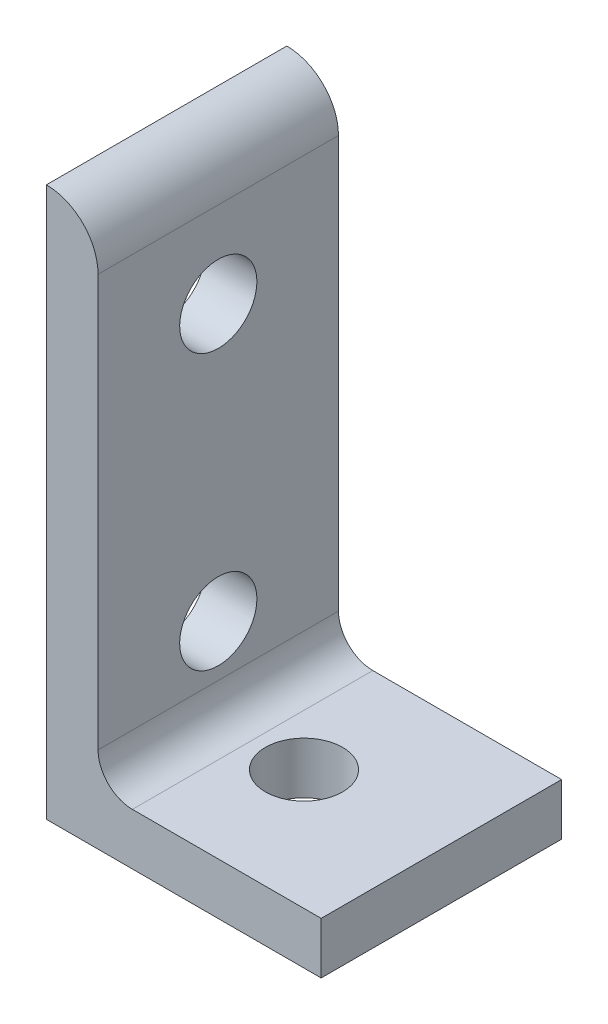
ISO-10303-21;
HEADER;
FILE_DESCRIPTION(('STEP AP214'),'2;1');
FILE_NAME('part.step','',(''),(''),'','','');
FILE_SCHEMA(('AUTOMOTIVE_DESIGN { 1 0 10303 214 1 1 1 1 }'));
ENDSEC;
DATA;
#1=APPLICATION_CONTEXT('core data for automotive mechanical design processes');
#2=APPLICATION_PROTOCOL_DEFINITION('international standard','automotive_design',2000,#1);
#3=PRODUCT_CONTEXT('',#1,'mechanical');
#4=PRODUCT('Part','Part','',(#3));
#5=PRODUCT_RELATED_PRODUCT_CATEGORY('part','',(#4));
#6=PRODUCT_DEFINITION_FORMATION('','',#4);
#7=PRODUCT_DEFINITION_CONTEXT('part definition',#1,'design');
#8=PRODUCT_DEFINITION('design','',#6,#7);
#9=PRODUCT_DEFINITION_SHAPE('','',#8);
#10=(LENGTH_UNIT() NAMED_UNIT(*) SI_UNIT(.MILLI.,.METRE.));
#11=(NAMED_UNIT(*) PLANE_ANGLE_UNIT() SI_UNIT($,.RADIAN.));
#12=(NAMED_UNIT(*) SI_UNIT($,.STERADIAN.) SOLID_ANGLE_UNIT());
#13=UNCERTAINTY_MEASURE_WITH_UNIT(LENGTH_MEASURE(1.E-05),#10,'distance_accuracy_value','');
#14=(GEOMETRIC_REPRESENTATION_CONTEXT(3) GLOBAL_UNCERTAINTY_ASSIGNED_CONTEXT((#13)) GLOBAL_UNIT_ASSIGNED_CONTEXT((#10,
#11,#12)) REPRESENTATION_CONTEXT('',''));
#15=CARTESIAN_POINT('',(0.,0.,0.));
#16=DIRECTION('',(0.,0.,1.));
#17=DIRECTION('',(1.,0.,0.));
#18=AXIS2_PLACEMENT_3D('',#15,#16,#17);
#19=CARTESIAN_POINT('',(4.7752,46.0248,11.1125));
#20=DIRECTION('',(-1.,0.,0.));
#21=DIRECTION('',(0.,-1.,0.));
#22=AXIS2_PLACEMENT_3D('',#19,#20,#21);
#23=PLANE('',#22);
#24=CARTESIAN_POINT('',(4.7752,12.7,0.));
#25=DIRECTION('',(-1.,0.,0.));
#26=DIRECTION('',(0.,-1.,0.));
#27=AXIS2_PLACEMENT_3D('',#24,#25,#26);
#28=CIRCLE('',#27,3.5687);
#29=CARTESIAN_POINT('',(4.7752,9.1313,0.));
#30=VERTEX_POINT('',#29);
#31=EDGE_CURVE('E154',#30,#30,#28,.F.);
#32=ORIENTED_EDGE('',*,*,#31,.F.);
#33=EDGE_LOOP('',(#32));
#34=FACE_BOUND('',#33,.T.);
#35=DIRECTION('',(0.,1.,0.));
#36=VECTOR('',#35,1.);
#37=CARTESIAN_POINT('',(4.7752,46.0248,-11.1125));
#38=LINE('',#37,#36);
#39=CARTESIAN_POINT('',(4.7752,7.9502,-11.1125));
#40=VERTEX_POINT('',#39);
#41=CARTESIAN_POINT('',(4.77519999999999,46.0248,-11.1125));
#42=VERTEX_POINT('',#41);
#43=EDGE_CURVE('E113',#40,#42,#38,.T.);
#44=ORIENTED_EDGE('',*,*,#43,.T.);
#45=DIRECTION('',(0.,0.,-1.));
#46=VECTOR('',#45,1.);
#47=CARTESIAN_POINT('',(4.77519999999999,46.0248,11.1125));
#48=LINE('',#47,#46);
#49=CARTESIAN_POINT('',(4.77519999999999,46.0248,11.1125));
#50=VERTEX_POINT('',#49);
#51=EDGE_CURVE('E110',#50,#42,#48,.T.);
#52=ORIENTED_EDGE('',*,*,#51,.F.);
#53=DIRECTION('',(0.,1.,0.));
#54=VECTOR('',#53,1.);
#55=CARTESIAN_POINT('',(4.7752,46.0248,11.1125));
#56=LINE('',#55,#54);
#57=CARTESIAN_POINT('',(4.7752,7.9502,11.1125));
#58=VERTEX_POINT('',#57);
#59=EDGE_CURVE('E97',#58,#50,#56,.T.);
#60=ORIENTED_EDGE('',*,*,#59,.F.);
#61=DIRECTION('',(0.,0.,-1.));
#62=VECTOR('',#61,1.);
#63=CARTESIAN_POINT('',(4.7752,7.9502,11.1125));
#64=LINE('',#63,#62);
#65=EDGE_CURVE('E42',#58,#40,#64,.T.);
#66=ORIENTED_EDGE('',*,*,#65,.T.);
#67=EDGE_LOOP('',(#44,#52,#60,#66));
#68=FACE_BOUND('',#67,.T.);
#69=CARTESIAN_POINT('',(4.77519999999999,38.1,0.));
#70=DIRECTION('',(-1.,0.,0.));
#71=DIRECTION('',(0.,-1.,0.));
#72=AXIS2_PLACEMENT_3D('',#69,#70,#71);
#73=CIRCLE('',#72,3.5687);
#74=CARTESIAN_POINT('',(4.77519999999999,34.5313,0.));
#75=VERTEX_POINT('',#74);
#76=EDGE_CURVE('E160',#75,#75,#73,.F.);
#77=ORIENTED_EDGE('',*,*,#76,.F.);
#78=EDGE_LOOP('',(#77));
#79=FACE_BOUND('',#78,.T.);
#80=ADVANCED_FACE('F33',(#34,#68,#79),#23,.F.);
#81=CARTESIAN_POINT('',(0.,0.,11.1125));
#82=DIRECTION('',(1.,0.,0.));
#83=DIRECTION('',(0.,0.,-1.));
#84=AXIS2_PLACEMENT_3D('',#81,#82,#83);
#85=PLANE('',#84);
#86=CARTESIAN_POINT('',(0.,12.7,0.));
#87=DIRECTION('',(1.,0.,0.));
#88=DIRECTION('',(0.,0.,-1.));
#89=AXIS2_PLACEMENT_3D('',#86,#87,#88);
#90=CIRCLE('',#89,3.5687);
#91=CARTESIAN_POINT('',(0.,12.7,-3.5687));
#92=VERTEX_POINT('',#91);
#93=EDGE_CURVE('E157',#92,#92,#90,.T.);
#94=ORIENTED_EDGE('',*,*,#93,.T.);
#95=EDGE_LOOP('',(#94));
#96=FACE_BOUND('',#95,.T.);
#97=DIRECTION('',(0.,-1.,0.));
#98=VECTOR('',#97,1.);
#99=CARTESIAN_POINT('',(0.,0.,-11.1125));
#100=LINE('',#99,#98);
#101=CARTESIAN_POINT('',(0.,50.8,-11.1125));
#102=VERTEX_POINT('',#101);
#103=CARTESIAN_POINT('',(0.,0.,-11.1125));
#104=VERTEX_POINT('',#103);
#105=EDGE_CURVE('E82',#102,#104,#100,.T.);
#106=ORIENTED_EDGE('',*,*,#105,.T.);
#107=DIRECTION('',(0.,0.,-1.));
#108=VECTOR('',#107,1.);
#109=CARTESIAN_POINT('',(0.,0.,11.1125));
#110=LINE('',#109,#108);
#111=CARTESIAN_POINT('',(0.,0.,11.1125));
#112=VERTEX_POINT('',#111);
#113=EDGE_CURVE('E120',#112,#104,#110,.T.);
#114=ORIENTED_EDGE('',*,*,#113,.F.);
#115=DIRECTION('',(0.,-1.,0.));
#116=VECTOR('',#115,1.);
#117=CARTESIAN_POINT('',(0.,0.,11.1125));
#118=LINE('',#117,#116);
#119=CARTESIAN_POINT('',(0.,50.8,11.1125));
#120=VERTEX_POINT('',#119);
#121=EDGE_CURVE('E58',#120,#112,#118,.T.);
#122=ORIENTED_EDGE('',*,*,#121,.F.);
#123=DIRECTION('',(0.,0.,-1.));
#124=VECTOR('',#123,1.);
#125=CARTESIAN_POINT('',(0.,50.8,11.1125));
#126=LINE('',#125,#124);
#127=EDGE_CURVE('E116',#120,#102,#126,.T.);
#128=ORIENTED_EDGE('',*,*,#127,.T.);
#129=EDGE_LOOP('',(#106,#114,#122,#128));
#130=FACE_BOUND('',#129,.T.);
#131=CARTESIAN_POINT('',(0.,38.1,0.));
#132=DIRECTION('',(1.,0.,0.));
#133=DIRECTION('',(0.,0.,-1.));
#134=AXIS2_PLACEMENT_3D('',#131,#132,#133);
#135=CIRCLE('',#134,3.5687);
#136=CARTESIAN_POINT('',(0.,38.1,-3.5687));
#137=VERTEX_POINT('',#136);
#138=EDGE_CURVE('E163',#137,#137,#135,.T.);
#139=ORIENTED_EDGE('',*,*,#138,.T.);
#140=EDGE_LOOP('',(#139));
#141=FACE_BOUND('',#140,.T.);
#142=ADVANCED_FACE('F144',(#96,#130,#141),#85,.F.);
#143=CARTESIAN_POINT('',(50.8,0.,11.1125));
#144=DIRECTION('',(0.,1.,0.));
#145=DIRECTION('',(-1.,0.,0.));
#146=AXIS2_PLACEMENT_3D('',#143,#144,#145);
#147=PLANE('',#146);
#148=CARTESIAN_POINT('',(12.7,0.,0.));
#149=DIRECTION('',(0.,1.,0.));
#150=DIRECTION('',(0.,0.,1.));
#151=AXIS2_PLACEMENT_3D('',#148,#149,#150);
#152=CIRCLE('',#151,3.5687);
#153=CARTESIAN_POINT('',(12.7,0.,3.5687));
#154=VERTEX_POINT('',#153);
#155=EDGE_CURVE('E151',#154,#154,#152,.T.);
#156=ORIENTED_EDGE('',*,*,#155,.T.);
#157=EDGE_LOOP('',(#156));
#158=FACE_BOUND('',#157,.T.);
#159=DIRECTION('',(1.,0.,0.));
#160=VECTOR('',#159,1.);
#161=CARTESIAN_POINT('',(50.8,0.,-11.1125));
#162=LINE('',#161,#160);
#163=CARTESIAN_POINT('',(25.4,0.,-11.1125));
#164=VERTEX_POINT('',#163);
#165=EDGE_CURVE('E124',#104,#164,#162,.T.);
#166=ORIENTED_EDGE('',*,*,#165,.T.);
#167=DIRECTION('',(0.,0.,-1.));
#168=VECTOR('',#167,1.);
#169=CARTESIAN_POINT('',(25.4,0.,-11.1125));
#170=LINE('',#169,#168);
#171=CARTESIAN_POINT('',(25.4,0.,11.1125));
#172=VERTEX_POINT('',#171);
#173=EDGE_CURVE('E49',#172,#164,#170,.T.);
#174=ORIENTED_EDGE('',*,*,#173,.F.);
#175=DIRECTION('',(1.,0.,0.));
#176=VECTOR('',#175,1.);
#177=CARTESIAN_POINT('',(50.8,0.,11.1125));
#178=LINE('',#177,#176);
#179=EDGE_CURVE('E135',#112,#172,#178,.T.);
#180=ORIENTED_EDGE('',*,*,#179,.F.);
#181=ORIENTED_EDGE('',*,*,#113,.T.);
#182=EDGE_LOOP('',(#166,#174,#180,#181));
#183=FACE_BOUND('',#182,.T.);
#184=ADVANCED_FACE('F35',(#158,#183),#147,.F.);
#185=CARTESIAN_POINT('',(7.9502,4.7752,11.1125));
#186=DIRECTION('',(0.,-1.,0.));
#187=DIRECTION('',(1.,0.,0.));
#188=AXIS2_PLACEMENT_3D('',#185,#186,#187);
#189=PLANE('',#188);
#190=CARTESIAN_POINT('',(12.7,4.7752,0.));
#191=DIRECTION('',(0.,-1.,0.));
#192=DIRECTION('',(1.,0.,0.));
#193=AXIS2_PLACEMENT_3D('',#190,#191,#192);
#194=CIRCLE('',#193,3.5687);
#195=CARTESIAN_POINT('',(16.2687,4.7752,0.));
#196=VERTEX_POINT('',#195);
#197=EDGE_CURVE('E37',#196,#196,#194,.F.);
#198=ORIENTED_EDGE('',*,*,#197,.F.);
#199=EDGE_LOOP('',(#198));
#200=FACE_BOUND('',#199,.T.);
#201=DIRECTION('',(-1.,0.,0.));
#202=VECTOR('',#201,1.);
#203=CARTESIAN_POINT('',(7.9502,4.7752,11.1125));
#204=LINE('',#203,#202);
#205=CARTESIAN_POINT('',(25.4,4.7752,11.1125));
#206=VERTEX_POINT('',#205);
#207=CARTESIAN_POINT('',(7.9502,4.7752,11.1125));
#208=VERTEX_POINT('',#207);
#209=EDGE_CURVE('E90',#206,#208,#204,.T.);
#210=ORIENTED_EDGE('',*,*,#209,.F.);
#211=DIRECTION('',(0.,0.,1.));
#212=VECTOR('',#211,1.);
#213=CARTESIAN_POINT('',(25.4,4.7752,-11.1125));
#214=LINE('',#213,#212);
#215=CARTESIAN_POINT('',(25.4,4.7752,-11.1125));
#216=VERTEX_POINT('',#215);
#217=EDGE_CURVE('E169',#216,#206,#214,.T.);
#218=ORIENTED_EDGE('',*,*,#217,.F.);
#219=DIRECTION('',(-1.,0.,0.));
#220=VECTOR('',#219,1.);
#221=CARTESIAN_POINT('',(7.9502,4.7752,-11.1125));
#222=LINE('',#221,#220);
#223=CARTESIAN_POINT('',(7.9502,4.7752,-11.1125));
#224=VERTEX_POINT('',#223);
#225=EDGE_CURVE('E127',#216,#224,#222,.T.);
#226=ORIENTED_EDGE('',*,*,#225,.T.);
#227=DIRECTION('',(0.,0.,-1.));
#228=VECTOR('',#227,1.);
#229=CARTESIAN_POINT('',(7.9502,4.7752,11.1125));
#230=LINE('',#229,#228);
#231=EDGE_CURVE('E11',#208,#224,#230,.T.);
#232=ORIENTED_EDGE('',*,*,#231,.F.);
#233=EDGE_LOOP('',(#210,#218,#226,#232));
#234=FACE_BOUND('',#233,.T.);
#235=ADVANCED_FACE('F178',(#200,#234),#189,.F.);
#236=CARTESIAN_POINT('',(7.9502,7.9502,11.1125));
#237=DIRECTION('',(0.,0.,-1.));
#238=DIRECTION('',(-1.,0.,0.));
#239=AXIS2_PLACEMENT_3D('',#236,#237,#238);
#240=CYLINDRICAL_SURFACE('',#239,3.175);
#241=CARTESIAN_POINT('',(7.9502,7.9502,-11.1125));
#242=DIRECTION('',(0.,0.,-1.));
#243=DIRECTION('',(1.,0.,0.));
#244=AXIS2_PLACEMENT_3D('',#241,#242,#243);
#245=CIRCLE('',#244,3.175);
#246=EDGE_CURVE('E129',#224,#40,#245,.T.);
#247=ORIENTED_EDGE('',*,*,#246,.T.);
#248=ORIENTED_EDGE('',*,*,#65,.F.);
#249=CARTESIAN_POINT('',(7.9502,7.9502,11.1125));
#250=DIRECTION('',(0.,0.,-1.));
#251=DIRECTION('',(1.,0.,0.));
#252=AXIS2_PLACEMENT_3D('',#249,#250,#251);
#253=CIRCLE('',#252,3.175);
#254=EDGE_CURVE('E104',#208,#58,#253,.T.);
#255=ORIENTED_EDGE('',*,*,#254,.F.);
#256=ORIENTED_EDGE('',*,*,#231,.T.);
#257=EDGE_LOOP('',(#247,#248,#255,#256));
#258=FACE_BOUND('',#257,.T.);
#259=ADVANCED_FACE('F179',(#258),#240,.F.);
#260=CARTESIAN_POINT('',(0.,46.0248,11.1125));
#261=DIRECTION('',(0.,0.,-1.));
#262=DIRECTION('',(-1.,0.,0.));
#263=AXIS2_PLACEMENT_3D('',#260,#261,#262);
#264=CYLINDRICAL_SURFACE('',#263,4.77519999999999);
#265=CARTESIAN_POINT('',(0.,46.0248,-11.1125));
#266=DIRECTION('',(0.,0.,1.));
#267=DIRECTION('',(1.,0.,0.));
#268=AXIS2_PLACEMENT_3D('',#265,#266,#267);
#269=CIRCLE('',#268,4.77519999999999);
#270=EDGE_CURVE('E132',#42,#102,#269,.T.);
#271=ORIENTED_EDGE('',*,*,#270,.T.);
#272=ORIENTED_EDGE('',*,*,#127,.F.);
#273=CARTESIAN_POINT('',(0.,46.0248,11.1125));
#274=DIRECTION('',(0.,0.,1.));
#275=DIRECTION('',(1.,0.,0.));
#276=AXIS2_PLACEMENT_3D('',#273,#274,#275);
#277=CIRCLE('',#276,4.77519999999999);
#278=EDGE_CURVE('E101',#50,#120,#277,.T.);
#279=ORIENTED_EDGE('',*,*,#278,.F.);
#280=ORIENTED_EDGE('',*,*,#51,.T.);
#281=EDGE_LOOP('',(#271,#272,#279,#280));
#282=FACE_BOUND('',#281,.T.);
#283=ADVANCED_FACE('F118',(#282),#264,.T.);
#284=CARTESIAN_POINT('',(0.,46.0248,11.1125));
#285=DIRECTION('',(0.,0.,1.));
#286=DIRECTION('',(1.,0.,0.));
#287=AXIS2_PLACEMENT_3D('',#284,#285,#286);
#288=PLANE('',#287);
#289=DIRECTION('',(0.,1.,0.));
#290=VECTOR('',#289,1.);
#291=CARTESIAN_POINT('',(25.4,-0.00100000000000187,11.1125));
#292=LINE('',#291,#290);
#293=EDGE_CURVE('E166',#172,#206,#292,.T.);
#294=ORIENTED_EDGE('',*,*,#293,.T.);
#295=ORIENTED_EDGE('',*,*,#209,.T.);
#296=ORIENTED_EDGE('',*,*,#254,.T.);
#297=ORIENTED_EDGE('',*,*,#59,.T.);
#298=ORIENTED_EDGE('',*,*,#278,.T.);
#299=ORIENTED_EDGE('',*,*,#121,.T.);
#300=ORIENTED_EDGE('',*,*,#179,.T.);
#301=EDGE_LOOP('',(#294,#295,#296,#297,#298,#299,#300));
#302=FACE_BOUND('',#301,.T.);
#303=ADVANCED_FACE('F99',(#302),#288,.T.);
#304=CARTESIAN_POINT('',(0.,46.0248,-11.1125));
#305=DIRECTION('',(0.,0.,1.));
#306=DIRECTION('',(1.,0.,0.));
#307=AXIS2_PLACEMENT_3D('',#304,#305,#306);
#308=PLANE('',#307);
#309=ORIENTED_EDGE('',*,*,#225,.F.);
#310=DIRECTION('',(0.,1.,0.));
#311=VECTOR('',#310,1.);
#312=CARTESIAN_POINT('',(25.4,-0.00100000000000187,-11.1125));
#313=LINE('',#312,#311);
#314=EDGE_CURVE('E167',#164,#216,#313,.T.);
#315=ORIENTED_EDGE('',*,*,#314,.F.);
#316=ORIENTED_EDGE('',*,*,#165,.F.);
#317=ORIENTED_EDGE('',*,*,#105,.F.);
#318=ORIENTED_EDGE('',*,*,#270,.F.);
#319=ORIENTED_EDGE('',*,*,#43,.F.);
#320=ORIENTED_EDGE('',*,*,#246,.F.);
#321=EDGE_LOOP('',(#309,#315,#316,#317,#318,#319,#320));
#322=FACE_BOUND('',#321,.T.);
#323=ADVANCED_FACE('F142',(#322),#308,.F.);
#324=CARTESIAN_POINT('',(12.7,50.8,0.));
#325=DIRECTION('',(0.,-1.,0.));
#326=DIRECTION('',(0.,0.,-1.));
#327=AXIS2_PLACEMENT_3D('',#324,#325,#326);
#328=CYLINDRICAL_SURFACE('',#327,3.5687);
#329=ORIENTED_EDGE('',*,*,#155,.F.);
#330=EDGE_LOOP('',(#329));
#331=FACE_BOUND('',#330,.T.);
#332=ORIENTED_EDGE('',*,*,#197,.T.);
#333=EDGE_LOOP('',(#332));
#334=FACE_BOUND('',#333,.T.);
#335=ADVANCED_FACE('F201',(#331,#334),#328,.F.);
#336=CARTESIAN_POINT('',(50.8,12.7,0.));
#337=DIRECTION('',(-1.,0.,0.));
#338=DIRECTION('',(0.,0.,1.));
#339=AXIS2_PLACEMENT_3D('',#336,#337,#338);
#340=CYLINDRICAL_SURFACE('',#339,3.5687);
#341=ORIENTED_EDGE('',*,*,#93,.F.);
#342=EDGE_LOOP('',(#341));
#343=FACE_BOUND('',#342,.T.);
#344=ORIENTED_EDGE('',*,*,#31,.T.);
#345=EDGE_LOOP('',(#344));
#346=FACE_BOUND('',#345,.T.);
#347=ADVANCED_FACE('F206',(#343,#346),#340,.F.);
#348=CARTESIAN_POINT('',(50.8,38.1,0.));
#349=DIRECTION('',(-1.,0.,0.));
#350=DIRECTION('',(0.,0.,1.));
#351=AXIS2_PLACEMENT_3D('',#348,#349,#350);
#352=CYLINDRICAL_SURFACE('',#351,3.5687);
#353=ORIENTED_EDGE('',*,*,#138,.F.);
#354=EDGE_LOOP('',(#353));
#355=FACE_BOUND('',#354,.T.);
#356=ORIENTED_EDGE('',*,*,#76,.T.);
#357=EDGE_LOOP('',(#356));
#358=FACE_BOUND('',#357,.T.);
#359=ADVANCED_FACE('F210',(#355,#358),#352,.F.);
#360=CARTESIAN_POINT('',(25.4,-0.00100000000000187,-11.1125));
#361=DIRECTION('',(-1.,0.,0.));
#362=DIRECTION('',(0.,0.,1.));
#363=AXIS2_PLACEMENT_3D('',#360,#361,#362);
#364=PLANE('',#363);
#365=ORIENTED_EDGE('',*,*,#173,.T.);
#366=ORIENTED_EDGE('',*,*,#314,.T.);
#367=ORIENTED_EDGE('',*,*,#217,.T.);
#368=ORIENTED_EDGE('',*,*,#293,.F.);
#369=EDGE_LOOP('',(#365,#366,#367,#368));
#370=FACE_BOUND('',#369,.T.);
#371=ADVANCED_FACE('F175',(#370),#364,.F.);
#372=CLOSED_SHELL('',(#80,#142,#184,#235,#259,#283,#303,#323,#335,#347,#359,#371));
#373=MANIFOLD_SOLID_BREP('B2',#372);
#374=ADVANCED_BREP_SHAPE_REPRESENTATION('',(#18,#373),#14);
#375=SHAPE_DEFINITION_REPRESENTATION(#9,#374);
ENDSEC;
END-ISO-10303-21;
